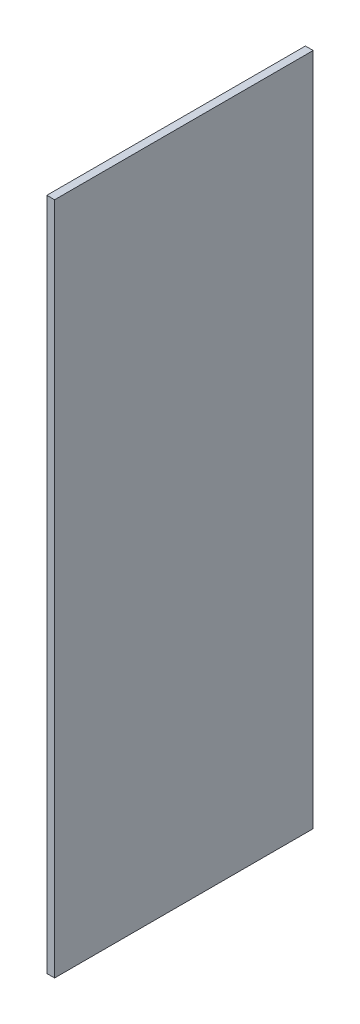
ISO-10303-21;
HEADER;
FILE_DESCRIPTION(('STEP AP214'),'2;1');
FILE_NAME('part.step','',(''),(''),'','','');
FILE_SCHEMA(('AUTOMOTIVE_DESIGN { 1 0 10303 214 1 1 1 1 }'));
ENDSEC;
DATA;
#1=APPLICATION_CONTEXT('core data for automotive mechanical design processes');
#2=APPLICATION_PROTOCOL_DEFINITION('international standard','automotive_design',2000,#1);
#3=PRODUCT_CONTEXT('',#1,'mechanical');
#4=PRODUCT('Part','Part','',(#3));
#5=PRODUCT_RELATED_PRODUCT_CATEGORY('part','',(#4));
#6=PRODUCT_DEFINITION_FORMATION('','',#4);
#7=PRODUCT_DEFINITION_CONTEXT('part definition',#1,'design');
#8=PRODUCT_DEFINITION('design','',#6,#7);
#9=PRODUCT_DEFINITION_SHAPE('','',#8);
#10=(LENGTH_UNIT() NAMED_UNIT(*) SI_UNIT(.MILLI.,.METRE.));
#11=(NAMED_UNIT(*) PLANE_ANGLE_UNIT() SI_UNIT($,.RADIAN.));
#12=(NAMED_UNIT(*) SI_UNIT($,.STERADIAN.) SOLID_ANGLE_UNIT());
#13=UNCERTAINTY_MEASURE_WITH_UNIT(LENGTH_MEASURE(1.E-05),#10,'distance_accuracy_value','');
#14=(GEOMETRIC_REPRESENTATION_CONTEXT(3) GLOBAL_UNCERTAINTY_ASSIGNED_CONTEXT((#13)) GLOBAL_UNIT_ASSIGNED_CONTEXT((#10,
#11,#12)) REPRESENTATION_CONTEXT('',''));
#15=CARTESIAN_POINT('',(0.,0.,0.));
#16=DIRECTION('',(0.,0.,1.));
#17=DIRECTION('',(1.,0.,0.));
#18=AXIS2_PLACEMENT_3D('',#15,#16,#17);
#19=CARTESIAN_POINT('',(18.,0.,0.));
#20=DIRECTION('',(0.,0.,-1.));
#21=DIRECTION('',(-1.,0.,0.));
#22=AXIS2_PLACEMENT_3D('',#19,#20,#21);
#23=PLANE('',#22);
#24=DIRECTION('',(0.,-1.,0.));
#25=VECTOR('',#24,1.);
#26=CARTESIAN_POINT('',(0.,0.,0.));
#27=LINE('',#26,#25);
#28=CARTESIAN_POINT('',(0.,1564.,0.));
#29=VERTEX_POINT('',#28);
#30=CARTESIAN_POINT('',(0.,0.,0.));
#31=VERTEX_POINT('',#30);
#32=EDGE_CURVE('E98',#29,#31,#27,.T.);
#33=ORIENTED_EDGE('',*,*,#32,.T.);
#34=DIRECTION('',(-1.,0.,0.));
#35=VECTOR('',#34,1.);
#36=CARTESIAN_POINT('',(18.,0.,0.));
#37=LINE('',#36,#35);
#38=CARTESIAN_POINT('',(18.,0.,0.));
#39=VERTEX_POINT('',#38);
#40=EDGE_CURVE('E11',#39,#31,#37,.T.);
#41=ORIENTED_EDGE('',*,*,#40,.F.);
#42=DIRECTION('',(0.,-1.,0.));
#43=VECTOR('',#42,1.);
#44=CARTESIAN_POINT('',(18.,0.,0.));
#45=LINE('',#44,#43);
#46=CARTESIAN_POINT('',(18.,1564.,0.));
#47=VERTEX_POINT('',#46);
#48=EDGE_CURVE('E86',#47,#39,#45,.T.);
#49=ORIENTED_EDGE('',*,*,#48,.F.);
#50=DIRECTION('',(-1.,0.,0.));
#51=VECTOR('',#50,1.);
#52=CARTESIAN_POINT('',(18.,1564.,0.));
#53=LINE('',#52,#51);
#54=EDGE_CURVE('E94',#47,#29,#53,.T.);
#55=ORIENTED_EDGE('',*,*,#54,.T.);
#56=EDGE_LOOP('',(#33,#41,#49,#55));
#57=FACE_BOUND('',#56,.T.);
#58=ADVANCED_FACE('F35',(#57),#23,.F.);
#59=CARTESIAN_POINT('',(18.,0.,0.));
#60=DIRECTION('',(0.,1.,0.));
#61=DIRECTION('',(0.,0.,1.));
#62=AXIS2_PLACEMENT_3D('',#59,#60,#61);
#63=PLANE('',#62);
#64=DIRECTION('',(0.,0.,-1.));
#65=VECTOR('',#64,1.);
#66=CARTESIAN_POINT('',(0.,0.,0.));
#67=LINE('',#66,#65);
#68=CARTESIAN_POINT('',(0.,0.,-600.));
#69=VERTEX_POINT('',#68);
#70=EDGE_CURVE('E90',#31,#69,#67,.T.);
#71=ORIENTED_EDGE('',*,*,#70,.T.);
#72=DIRECTION('',(-1.,0.,0.));
#73=VECTOR('',#72,1.);
#74=CARTESIAN_POINT('',(18.,0.,-600.));
#75=LINE('',#74,#73);
#76=CARTESIAN_POINT('',(18.,0.,-600.));
#77=VERTEX_POINT('',#76);
#78=EDGE_CURVE('E43',#77,#69,#75,.T.);
#79=ORIENTED_EDGE('',*,*,#78,.F.);
#80=DIRECTION('',(0.,0.,-1.));
#81=VECTOR('',#80,1.);
#82=CARTESIAN_POINT('',(18.,0.,0.));
#83=LINE('',#82,#81);
#84=EDGE_CURVE('E81',#39,#77,#83,.T.);
#85=ORIENTED_EDGE('',*,*,#84,.F.);
#86=ORIENTED_EDGE('',*,*,#40,.T.);
#87=EDGE_LOOP('',(#71,#79,#85,#86));
#88=FACE_BOUND('',#87,.T.);
#89=ADVANCED_FACE('F89',(#88),#63,.F.);
#90=CARTESIAN_POINT('',(18.,0.,-600.));
#91=DIRECTION('',(0.,0.,1.));
#92=DIRECTION('',(1.,0.,0.));
#93=AXIS2_PLACEMENT_3D('',#90,#91,#92);
#94=PLANE('',#93);
#95=DIRECTION('',(0.,1.,0.));
#96=VECTOR('',#95,1.);
#97=CARTESIAN_POINT('',(0.,0.,-600.));
#98=LINE('',#97,#96);
#99=CARTESIAN_POINT('',(0.,1564.,-600.));
#100=VERTEX_POINT('',#99);
#101=EDGE_CURVE('E68',#69,#100,#98,.T.);
#102=ORIENTED_EDGE('',*,*,#101,.T.);
#103=DIRECTION('',(-1.,0.,0.));
#104=VECTOR('',#103,1.);
#105=CARTESIAN_POINT('',(18.,1564.,-600.));
#106=LINE('',#105,#104);
#107=CARTESIAN_POINT('',(18.,1564.,-600.));
#108=VERTEX_POINT('',#107);
#109=EDGE_CURVE('E91',#108,#100,#106,.T.);
#110=ORIENTED_EDGE('',*,*,#109,.F.);
#111=DIRECTION('',(0.,1.,0.));
#112=VECTOR('',#111,1.);
#113=CARTESIAN_POINT('',(18.,0.,-600.));
#114=LINE('',#113,#112);
#115=EDGE_CURVE('E84',#77,#108,#114,.T.);
#116=ORIENTED_EDGE('',*,*,#115,.F.);
#117=ORIENTED_EDGE('',*,*,#78,.T.);
#118=EDGE_LOOP('',(#102,#110,#116,#117));
#119=FACE_BOUND('',#118,.T.);
#120=ADVANCED_FACE('F92',(#119),#94,.F.);
#121=CARTESIAN_POINT('',(18.,1564.,0.));
#122=DIRECTION('',(0.,-1.,0.));
#123=DIRECTION('',(0.,0.,-1.));
#124=AXIS2_PLACEMENT_3D('',#121,#122,#123);
#125=PLANE('',#124);
#126=DIRECTION('',(0.,0.,1.));
#127=VECTOR('',#126,1.);
#128=CARTESIAN_POINT('',(0.,1564.,0.));
#129=LINE('',#128,#127);
#130=EDGE_CURVE('E74',#100,#29,#129,.T.);
#131=ORIENTED_EDGE('',*,*,#130,.T.);
#132=ORIENTED_EDGE('',*,*,#54,.F.);
#133=DIRECTION('',(0.,0.,1.));
#134=VECTOR('',#133,1.);
#135=CARTESIAN_POINT('',(18.,1564.,0.));
#136=LINE('',#135,#134);
#137=EDGE_CURVE('E51',#108,#47,#136,.T.);
#138=ORIENTED_EDGE('',*,*,#137,.F.);
#139=ORIENTED_EDGE('',*,*,#109,.T.);
#140=EDGE_LOOP('',(#131,#132,#138,#139));
#141=FACE_BOUND('',#140,.T.);
#142=ADVANCED_FACE('F105',(#141),#125,.F.);
#143=CARTESIAN_POINT('',(18.,0.,0.));
#144=DIRECTION('',(-1.,0.,0.));
#145=DIRECTION('',(0.,0.,1.));
#146=AXIS2_PLACEMENT_3D('',#143,#144,#145);
#147=PLANE('',#146);
#148=ORIENTED_EDGE('',*,*,#48,.T.);
#149=ORIENTED_EDGE('',*,*,#84,.T.);
#150=ORIENTED_EDGE('',*,*,#115,.T.);
#151=ORIENTED_EDGE('',*,*,#137,.T.);
#152=EDGE_LOOP('',(#148,#149,#150,#151));
#153=FACE_BOUND('',#152,.T.);
#154=ADVANCED_FACE('F82',(#153),#147,.F.);
#155=CARTESIAN_POINT('',(0.,0.,0.));
#156=DIRECTION('',(-1.,0.,0.));
#157=DIRECTION('',(0.,0.,1.));
#158=AXIS2_PLACEMENT_3D('',#155,#156,#157);
#159=PLANE('',#158);
#160=ORIENTED_EDGE('',*,*,#32,.F.);
#161=ORIENTED_EDGE('',*,*,#130,.F.);
#162=ORIENTED_EDGE('',*,*,#101,.F.);
#163=ORIENTED_EDGE('',*,*,#70,.F.);
#164=EDGE_LOOP('',(#160,#161,#162,#163));
#165=FACE_BOUND('',#164,.T.);
#166=ADVANCED_FACE('F108',(#165),#159,.T.);
#167=CLOSED_SHELL('',(#58,#89,#120,#142,#154,#166));
#168=MANIFOLD_SOLID_BREP('B2',#167);
#169=ADVANCED_BREP_SHAPE_REPRESENTATION('',(#18,#168),#14);
#170=SHAPE_DEFINITION_REPRESENTATION(#9,#169);
ENDSEC;
END-ISO-10303-21;
